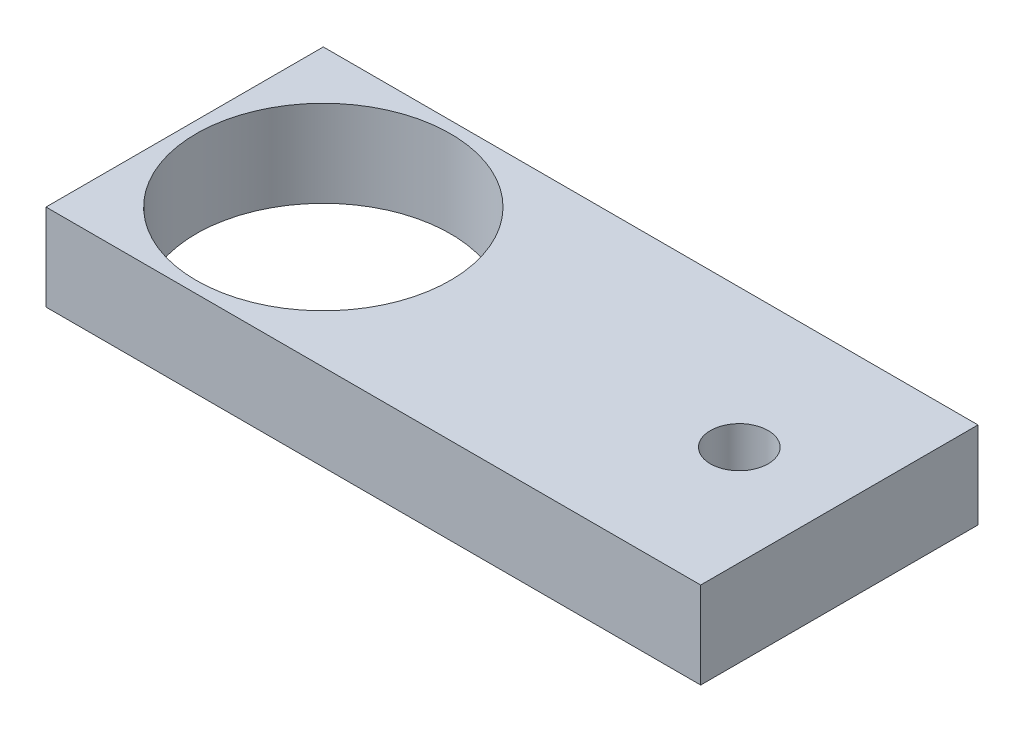
ISO-10303-21;
HEADER;
FILE_DESCRIPTION(('STEP AP214'),'2;1');
FILE_NAME('part.step','',(''),(''),'','','');
FILE_SCHEMA(('AUTOMOTIVE_DESIGN { 1 0 10303 214 1 1 1 1 }'));
ENDSEC;
DATA;
#1=APPLICATION_CONTEXT('core data for automotive mechanical design processes');
#2=APPLICATION_PROTOCOL_DEFINITION('international standard','automotive_design',2000,#1);
#3=PRODUCT_CONTEXT('',#1,'mechanical');
#4=PRODUCT('Part','Part','',(#3));
#5=PRODUCT_RELATED_PRODUCT_CATEGORY('part','',(#4));
#6=PRODUCT_DEFINITION_FORMATION('','',#4);
#7=PRODUCT_DEFINITION_CONTEXT('part definition',#1,'design');
#8=PRODUCT_DEFINITION('design','',#6,#7);
#9=PRODUCT_DEFINITION_SHAPE('','',#8);
#10=(LENGTH_UNIT() NAMED_UNIT(*) SI_UNIT(.MILLI.,.METRE.));
#11=(NAMED_UNIT(*) PLANE_ANGLE_UNIT() SI_UNIT($,.RADIAN.));
#12=(NAMED_UNIT(*) SI_UNIT($,.STERADIAN.) SOLID_ANGLE_UNIT());
#13=UNCERTAINTY_MEASURE_WITH_UNIT(LENGTH_MEASURE(1.E-05),#10,'distance_accuracy_value','');
#14=(GEOMETRIC_REPRESENTATION_CONTEXT(3) GLOBAL_UNCERTAINTY_ASSIGNED_CONTEXT((#13)) GLOBAL_UNIT_ASSIGNED_CONTEXT((#10,
#11,#12)) REPRESENTATION_CONTEXT('',''));
#15=CARTESIAN_POINT('',(0.,0.,0.));
#16=DIRECTION('',(0.,0.,1.));
#17=DIRECTION('',(1.,0.,0.));
#18=AXIS2_PLACEMENT_3D('',#15,#16,#17);
#19=CARTESIAN_POINT('',(0.,15.,0.));
#20=DIRECTION('',(0.,-1.,0.));
#21=DIRECTION('',(0.,0.,-1.));
#22=AXIS2_PLACEMENT_3D('',#19,#20,#21);
#23=PLANE('',#22);
#24=DIRECTION('',(0.,0.,1.));
#25=VECTOR('',#24,1.);
#26=CARTESIAN_POINT('',(0.,15.,0.));
#27=LINE('',#26,#25);
#28=CARTESIAN_POINT('',(0.,15.,-48.));
#29=VERTEX_POINT('',#28);
#30=CARTESIAN_POINT('',(0.,15.,0.));
#31=VERTEX_POINT('',#30);
#32=EDGE_CURVE('E84',#29,#31,#27,.T.);
#33=ORIENTED_EDGE('',*,*,#32,.T.);
#34=DIRECTION('',(1.,0.,0.));
#35=VECTOR('',#34,1.);
#36=CARTESIAN_POINT('',(0.,15.,0.));
#37=LINE('',#36,#35);
#38=CARTESIAN_POINT('',(113.319310707439,15.,0.));
#39=VERTEX_POINT('',#38);
#40=EDGE_CURVE('E79',#31,#39,#37,.T.);
#41=ORIENTED_EDGE('',*,*,#40,.T.);
#42=DIRECTION('',(0.,0.,-1.));
#43=VECTOR('',#42,1.);
#44=CARTESIAN_POINT('',(113.319310707439,15.,0.));
#45=LINE('',#44,#43);
#46=CARTESIAN_POINT('',(113.319310707439,15.,-48.));
#47=VERTEX_POINT('',#46);
#48=EDGE_CURVE('E82',#39,#47,#45,.T.);
#49=ORIENTED_EDGE('',*,*,#48,.T.);
#50=DIRECTION('',(-1.,0.,0.));
#51=VECTOR('',#50,1.);
#52=CARTESIAN_POINT('',(0.,15.,-48.));
#53=LINE('',#52,#51);
#54=EDGE_CURVE('E49',#47,#29,#53,.T.);
#55=ORIENTED_EDGE('',*,*,#54,.T.);
#56=EDGE_LOOP('',(#33,#41,#49,#55));
#57=FACE_BOUND('',#56,.T.);
#58=CARTESIAN_POINT('',(24.,15.,-24.));
#59=DIRECTION('',(0.,1.,0.));
#60=DIRECTION('',(0.,0.,1.));
#61=AXIS2_PLACEMENT_3D('',#58,#59,#60);
#62=CIRCLE('',#61,22.);
#63=CARTESIAN_POINT('',(24.,15.,-2.));
#64=VERTEX_POINT('',#63);
#65=EDGE_CURVE('E99',#64,#64,#62,.T.);
#66=ORIENTED_EDGE('',*,*,#65,.F.);
#67=EDGE_LOOP('',(#66));
#68=FACE_BOUND('',#67,.T.);
#69=CARTESIAN_POINT('',(96.,15.,-24.));
#70=DIRECTION('',(0.,1.,0.));
#71=DIRECTION('',(0.,0.,1.));
#72=AXIS2_PLACEMENT_3D('',#69,#70,#71);
#73=CIRCLE('',#72,5.);
#74=CARTESIAN_POINT('',(96.,15.,-19.));
#75=VERTEX_POINT('',#74);
#76=EDGE_CURVE('E114',#75,#75,#73,.T.);
#77=ORIENTED_EDGE('',*,*,#76,.F.);
#78=EDGE_LOOP('',(#77));
#79=FACE_BOUND('',#78,.T.);
#80=ADVANCED_FACE('F32',(#57,#68,#79),#23,.F.);
#81=CARTESIAN_POINT('',(0.,0.,0.));
#82=DIRECTION('',(0.,-1.,0.));
#83=DIRECTION('',(0.,0.,-1.));
#84=AXIS2_PLACEMENT_3D('',#81,#82,#83);
#85=PLANE('',#84);
#86=CARTESIAN_POINT('',(24.,0.,-24.));
#87=DIRECTION('',(0.,1.,0.));
#88=DIRECTION('',(0.,0.,1.));
#89=AXIS2_PLACEMENT_3D('',#86,#87,#88);
#90=CIRCLE('',#89,22.);
#91=CARTESIAN_POINT('',(24.,0.,-2.));
#92=VERTEX_POINT('',#91);
#93=EDGE_CURVE('E111',#92,#92,#90,.T.);
#94=ORIENTED_EDGE('',*,*,#93,.T.);
#95=EDGE_LOOP('',(#94));
#96=FACE_BOUND('',#95,.T.);
#97=DIRECTION('',(0.,0.,1.));
#98=VECTOR('',#97,1.);
#99=CARTESIAN_POINT('',(0.,0.,0.));
#100=LINE('',#99,#98);
#101=CARTESIAN_POINT('',(0.,0.,-48.));
#102=VERTEX_POINT('',#101);
#103=CARTESIAN_POINT('',(0.,0.,0.));
#104=VERTEX_POINT('',#103);
#105=EDGE_CURVE('E96',#102,#104,#100,.T.);
#106=ORIENTED_EDGE('',*,*,#105,.F.);
#107=DIRECTION('',(-1.,0.,0.));
#108=VECTOR('',#107,1.);
#109=CARTESIAN_POINT('',(0.,0.,-48.));
#110=LINE('',#109,#108);
#111=CARTESIAN_POINT('',(113.319310707439,0.,-48.));
#112=VERTEX_POINT('',#111);
#113=EDGE_CURVE('E72',#112,#102,#110,.T.);
#114=ORIENTED_EDGE('',*,*,#113,.F.);
#115=DIRECTION('',(0.,0.,-1.));
#116=VECTOR('',#115,1.);
#117=CARTESIAN_POINT('',(113.319310707439,0.,0.));
#118=LINE('',#117,#116);
#119=CARTESIAN_POINT('',(113.319310707439,0.,0.));
#120=VERTEX_POINT('',#119);
#121=EDGE_CURVE('E66',#120,#112,#118,.T.);
#122=ORIENTED_EDGE('',*,*,#121,.F.);
#123=DIRECTION('',(1.,0.,0.));
#124=VECTOR('',#123,1.);
#125=CARTESIAN_POINT('',(0.,0.,0.));
#126=LINE('',#125,#124);
#127=EDGE_CURVE('E88',#104,#120,#126,.T.);
#128=ORIENTED_EDGE('',*,*,#127,.F.);
#129=EDGE_LOOP('',(#106,#114,#122,#128));
#130=FACE_BOUND('',#129,.T.);
#131=CARTESIAN_POINT('',(96.,0.,-24.));
#132=DIRECTION('',(0.,1.,0.));
#133=DIRECTION('',(0.,0.,1.));
#134=AXIS2_PLACEMENT_3D('',#131,#132,#133);
#135=CIRCLE('',#134,5.);
#136=CARTESIAN_POINT('',(96.,0.,-19.));
#137=VERTEX_POINT('',#136);
#138=EDGE_CURVE('E117',#137,#137,#135,.T.);
#139=ORIENTED_EDGE('',*,*,#138,.T.);
#140=EDGE_LOOP('',(#139));
#141=FACE_BOUND('',#140,.T.);
#142=ADVANCED_FACE('F107',(#96,#130,#141),#85,.T.);
#143=CARTESIAN_POINT('',(0.,15.,0.));
#144=DIRECTION('',(1.,0.,0.));
#145=DIRECTION('',(0.,0.,-1.));
#146=AXIS2_PLACEMENT_3D('',#143,#144,#145);
#147=PLANE('',#146);
#148=ORIENTED_EDGE('',*,*,#105,.T.);
#149=DIRECTION('',(0.,-1.,0.));
#150=VECTOR('',#149,1.);
#151=CARTESIAN_POINT('',(0.,15.,0.));
#152=LINE('',#151,#150);
#153=EDGE_CURVE('E11',#31,#104,#152,.T.);
#154=ORIENTED_EDGE('',*,*,#153,.F.);
#155=ORIENTED_EDGE('',*,*,#32,.F.);
#156=DIRECTION('',(0.,-1.,0.));
#157=VECTOR('',#156,1.);
#158=CARTESIAN_POINT('',(0.,15.,-48.));
#159=LINE('',#158,#157);
#160=EDGE_CURVE('E92',#29,#102,#159,.T.);
#161=ORIENTED_EDGE('',*,*,#160,.T.);
#162=EDGE_LOOP('',(#148,#154,#155,#161));
#163=FACE_BOUND('',#162,.T.);
#164=ADVANCED_FACE('F34',(#163),#147,.F.);
#165=CARTESIAN_POINT('',(0.,15.,0.));
#166=DIRECTION('',(0.,0.,-1.));
#167=DIRECTION('',(-1.,0.,0.));
#168=AXIS2_PLACEMENT_3D('',#165,#166,#167);
#169=PLANE('',#168);
#170=ORIENTED_EDGE('',*,*,#127,.T.);
#171=DIRECTION('',(0.,-1.,0.));
#172=VECTOR('',#171,1.);
#173=CARTESIAN_POINT('',(113.319310707439,15.,0.));
#174=LINE('',#173,#172);
#175=EDGE_CURVE('E41',#39,#120,#174,.T.);
#176=ORIENTED_EDGE('',*,*,#175,.F.);
#177=ORIENTED_EDGE('',*,*,#40,.F.);
#178=ORIENTED_EDGE('',*,*,#153,.T.);
#179=EDGE_LOOP('',(#170,#176,#177,#178));
#180=FACE_BOUND('',#179,.T.);
#181=ADVANCED_FACE('F87',(#180),#169,.F.);
#182=CARTESIAN_POINT('',(113.319310707439,15.,0.));
#183=DIRECTION('',(-1.,0.,0.));
#184=DIRECTION('',(0.,0.,1.));
#185=AXIS2_PLACEMENT_3D('',#182,#183,#184);
#186=PLANE('',#185);
#187=ORIENTED_EDGE('',*,*,#121,.T.);
#188=DIRECTION('',(0.,-1.,0.));
#189=VECTOR('',#188,1.);
#190=CARTESIAN_POINT('',(113.319310707439,15.,-48.));
#191=LINE('',#190,#189);
#192=EDGE_CURVE('E89',#47,#112,#191,.T.);
#193=ORIENTED_EDGE('',*,*,#192,.F.);
#194=ORIENTED_EDGE('',*,*,#48,.F.);
#195=ORIENTED_EDGE('',*,*,#175,.T.);
#196=EDGE_LOOP('',(#187,#193,#194,#195));
#197=FACE_BOUND('',#196,.T.);
#198=ADVANCED_FACE('F90',(#197),#186,.F.);
#199=CARTESIAN_POINT('',(0.,15.,-48.));
#200=DIRECTION('',(0.,0.,1.));
#201=DIRECTION('',(1.,0.,0.));
#202=AXIS2_PLACEMENT_3D('',#199,#200,#201);
#203=PLANE('',#202);
#204=ORIENTED_EDGE('',*,*,#113,.T.);
#205=ORIENTED_EDGE('',*,*,#160,.F.);
#206=ORIENTED_EDGE('',*,*,#54,.F.);
#207=ORIENTED_EDGE('',*,*,#192,.T.);
#208=EDGE_LOOP('',(#204,#205,#206,#207));
#209=FACE_BOUND('',#208,.T.);
#210=ADVANCED_FACE('F104',(#209),#203,.F.);
#211=CARTESIAN_POINT('',(24.,15.,-24.));
#212=DIRECTION('',(0.,-1.,0.));
#213=DIRECTION('',(0.,0.,-1.));
#214=AXIS2_PLACEMENT_3D('',#211,#212,#213);
#215=CYLINDRICAL_SURFACE('',#214,22.);
#216=ORIENTED_EDGE('',*,*,#65,.T.);
#217=EDGE_LOOP('',(#216));
#218=FACE_BOUND('',#217,.T.);
#219=ORIENTED_EDGE('',*,*,#93,.F.);
#220=EDGE_LOOP('',(#219));
#221=FACE_BOUND('',#220,.T.);
#222=ADVANCED_FACE('F134',(#218,#221),#215,.F.);
#223=CARTESIAN_POINT('',(96.,15.,-24.));
#224=DIRECTION('',(0.,-1.,0.));
#225=DIRECTION('',(0.,0.,-1.));
#226=AXIS2_PLACEMENT_3D('',#223,#224,#225);
#227=CYLINDRICAL_SURFACE('',#226,5.);
#228=ORIENTED_EDGE('',*,*,#76,.T.);
#229=EDGE_LOOP('',(#228));
#230=FACE_BOUND('',#229,.T.);
#231=ORIENTED_EDGE('',*,*,#138,.F.);
#232=EDGE_LOOP('',(#231));
#233=FACE_BOUND('',#232,.T.);
#234=ADVANCED_FACE('F123',(#230,#233),#227,.F.);
#235=CLOSED_SHELL('',(#80,#142,#164,#181,#198,#210,#222,#234));
#236=MANIFOLD_SOLID_BREP('B2',#235);
#237=ADVANCED_BREP_SHAPE_REPRESENTATION('',(#18,#236),#14);
#238=SHAPE_DEFINITION_REPRESENTATION(#9,#237);
ENDSEC;
END-ISO-10303-21;
